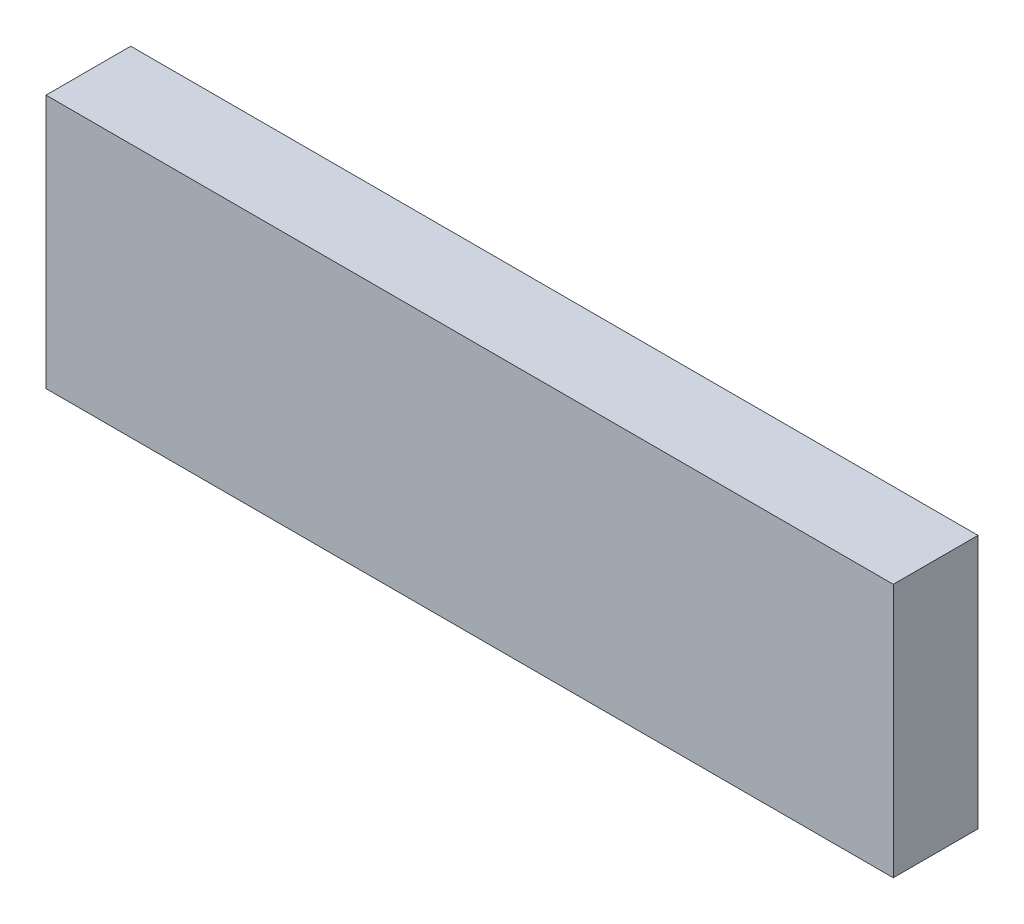
ISO-10303-21;
HEADER;
FILE_DESCRIPTION(('STEP AP214'),'2;1');
FILE_NAME('part.step','',(''),(''),'','','');
FILE_SCHEMA(('AUTOMOTIVE_DESIGN { 1 0 10303 214 1 1 1 1 }'));
ENDSEC;
DATA;
#1=APPLICATION_CONTEXT('core data for automotive mechanical design processes');
#2=APPLICATION_PROTOCOL_DEFINITION('international standard','automotive_design',2000,#1);
#3=PRODUCT_CONTEXT('',#1,'mechanical');
#4=PRODUCT('Part','Part','',(#3));
#5=PRODUCT_RELATED_PRODUCT_CATEGORY('part','',(#4));
#6=PRODUCT_DEFINITION_FORMATION('','',#4);
#7=PRODUCT_DEFINITION_CONTEXT('part definition',#1,'design');
#8=PRODUCT_DEFINITION('design','',#6,#7);
#9=PRODUCT_DEFINITION_SHAPE('','',#8);
#10=(LENGTH_UNIT() NAMED_UNIT(*) SI_UNIT(.MILLI.,.METRE.));
#11=(NAMED_UNIT(*) PLANE_ANGLE_UNIT() SI_UNIT($,.RADIAN.));
#12=(NAMED_UNIT(*) SI_UNIT($,.STERADIAN.) SOLID_ANGLE_UNIT());
#13=UNCERTAINTY_MEASURE_WITH_UNIT(LENGTH_MEASURE(1.E-05),#10,'distance_accuracy_value','');
#14=(GEOMETRIC_REPRESENTATION_CONTEXT(3) GLOBAL_UNCERTAINTY_ASSIGNED_CONTEXT((#13)) GLOBAL_UNIT_ASSIGNED_CONTEXT((#10,
#11,#12)) REPRESENTATION_CONTEXT('',''));
#15=CARTESIAN_POINT('',(0.,0.,0.));
#16=DIRECTION('',(0.,0.,1.));
#17=DIRECTION('',(1.,0.,0.));
#18=AXIS2_PLACEMENT_3D('',#15,#16,#17);
#19=CARTESIAN_POINT('',(-88.3485610984815,42.5439817471528,10.));
#20=DIRECTION('',(1.,0.,0.));
#21=DIRECTION('',(0.,0.,-1.));
#22=AXIS2_PLACEMENT_3D('',#19,#20,#21);
#23=PLANE('',#22);
#24=DIRECTION('',(0.,-1.,0.));
#25=VECTOR('',#24,1.);
#26=CARTESIAN_POINT('',(-88.3485610984815,42.5439817471528,0.));
#27=LINE('',#26,#25);
#28=CARTESIAN_POINT('',(-88.3485610984815,42.5439817471528,0.));
#29=VERTEX_POINT('',#28);
#30=CARTESIAN_POINT('',(-88.3485610984815,12.5439817471528,0.));
#31=VERTEX_POINT('',#30);
#32=EDGE_CURVE('E95',#29,#31,#27,.T.);
#33=ORIENTED_EDGE('',*,*,#32,.T.);
#34=DIRECTION('',(0.,0.,-1.));
#35=VECTOR('',#34,1.);
#36=CARTESIAN_POINT('',(-88.3485610984815,12.5439817471528,10.));
#37=LINE('',#36,#35);
#38=CARTESIAN_POINT('',(-88.3485610984815,12.5439817471528,10.));
#39=VERTEX_POINT('',#38);
#40=EDGE_CURVE('E11',#39,#31,#37,.T.);
#41=ORIENTED_EDGE('',*,*,#40,.F.);
#42=DIRECTION('',(0.,-1.,0.));
#43=VECTOR('',#42,1.);
#44=CARTESIAN_POINT('',(-88.3485610984815,42.5439817471528,10.));
#45=LINE('',#44,#43);
#46=CARTESIAN_POINT('',(-88.3485610984815,42.5439817471528,10.));
#47=VERTEX_POINT('',#46);
#48=EDGE_CURVE('E83',#47,#39,#45,.T.);
#49=ORIENTED_EDGE('',*,*,#48,.F.);
#50=DIRECTION('',(0.,0.,-1.));
#51=VECTOR('',#50,1.);
#52=CARTESIAN_POINT('',(-88.3485610984815,42.5439817471528,10.));
#53=LINE('',#52,#51);
#54=EDGE_CURVE('E91',#47,#29,#53,.T.);
#55=ORIENTED_EDGE('',*,*,#54,.T.);
#56=EDGE_LOOP('',(#33,#41,#49,#55));
#57=FACE_BOUND('',#56,.T.);
#58=ADVANCED_FACE('F32',(#57),#23,.F.);
#59=CARTESIAN_POINT('',(-88.3485610984815,12.5439817471528,10.));
#60=DIRECTION('',(0.,1.,0.));
#61=DIRECTION('',(0.,0.,1.));
#62=AXIS2_PLACEMENT_3D('',#59,#60,#61);
#63=PLANE('',#62);
#64=DIRECTION('',(1.,0.,0.));
#65=VECTOR('',#64,1.);
#66=CARTESIAN_POINT('',(-88.3485610984815,12.5439817471528,0.));
#67=LINE('',#66,#65);
#68=CARTESIAN_POINT('',(11.6514389015185,12.5439817471528,0.));
#69=VERTEX_POINT('',#68);
#70=EDGE_CURVE('E87',#31,#69,#67,.T.);
#71=ORIENTED_EDGE('',*,*,#70,.T.);
#72=DIRECTION('',(0.,0.,-1.));
#73=VECTOR('',#72,1.);
#74=CARTESIAN_POINT('',(11.6514389015185,12.5439817471528,10.));
#75=LINE('',#74,#73);
#76=CARTESIAN_POINT('',(11.6514389015185,12.5439817471528,10.));
#77=VERTEX_POINT('',#76);
#78=EDGE_CURVE('E40',#77,#69,#75,.T.);
#79=ORIENTED_EDGE('',*,*,#78,.F.);
#80=DIRECTION('',(1.,0.,0.));
#81=VECTOR('',#80,1.);
#82=CARTESIAN_POINT('',(-88.3485610984815,12.5439817471528,10.));
#83=LINE('',#82,#81);
#84=EDGE_CURVE('E78',#39,#77,#83,.T.);
#85=ORIENTED_EDGE('',*,*,#84,.F.);
#86=ORIENTED_EDGE('',*,*,#40,.T.);
#87=EDGE_LOOP('',(#71,#79,#85,#86));
#88=FACE_BOUND('',#87,.T.);
#89=ADVANCED_FACE('F86',(#88),#63,.F.);
#90=CARTESIAN_POINT('',(11.6514389015185,42.5439817471528,10.));
#91=DIRECTION('',(-1.,0.,0.));
#92=DIRECTION('',(0.,0.,1.));
#93=AXIS2_PLACEMENT_3D('',#90,#91,#92);
#94=PLANE('',#93);
#95=DIRECTION('',(0.,1.,0.));
#96=VECTOR('',#95,1.);
#97=CARTESIAN_POINT('',(11.6514389015185,42.5439817471528,0.));
#98=LINE('',#97,#96);
#99=CARTESIAN_POINT('',(11.6514389015185,42.5439817471528,0.));
#100=VERTEX_POINT('',#99);
#101=EDGE_CURVE('E65',#69,#100,#98,.T.);
#102=ORIENTED_EDGE('',*,*,#101,.T.);
#103=DIRECTION('',(0.,0.,-1.));
#104=VECTOR('',#103,1.);
#105=CARTESIAN_POINT('',(11.6514389015185,42.5439817471528,10.));
#106=LINE('',#105,#104);
#107=CARTESIAN_POINT('',(11.6514389015185,42.5439817471528,10.));
#108=VERTEX_POINT('',#107);
#109=EDGE_CURVE('E88',#108,#100,#106,.T.);
#110=ORIENTED_EDGE('',*,*,#109,.F.);
#111=DIRECTION('',(0.,1.,0.));
#112=VECTOR('',#111,1.);
#113=CARTESIAN_POINT('',(11.6514389015185,42.5439817471528,10.));
#114=LINE('',#113,#112);
#115=EDGE_CURVE('E81',#77,#108,#114,.T.);
#116=ORIENTED_EDGE('',*,*,#115,.F.);
#117=ORIENTED_EDGE('',*,*,#78,.T.);
#118=EDGE_LOOP('',(#102,#110,#116,#117));
#119=FACE_BOUND('',#118,.T.);
#120=ADVANCED_FACE('F89',(#119),#94,.F.);
#121=CARTESIAN_POINT('',(-88.3485610984815,42.5439817471528,10.));
#122=DIRECTION('',(0.,-1.,0.));
#123=DIRECTION('',(0.,0.,-1.));
#124=AXIS2_PLACEMENT_3D('',#121,#122,#123);
#125=PLANE('',#124);
#126=DIRECTION('',(-1.,0.,0.));
#127=VECTOR('',#126,1.);
#128=CARTESIAN_POINT('',(-88.3485610984815,42.5439817471528,0.));
#129=LINE('',#128,#127);
#130=EDGE_CURVE('E71',#100,#29,#129,.T.);
#131=ORIENTED_EDGE('',*,*,#130,.T.);
#132=ORIENTED_EDGE('',*,*,#54,.F.);
#133=DIRECTION('',(-1.,0.,0.));
#134=VECTOR('',#133,1.);
#135=CARTESIAN_POINT('',(-88.3485610984815,42.5439817471528,10.));
#136=LINE('',#135,#134);
#137=EDGE_CURVE('E48',#108,#47,#136,.T.);
#138=ORIENTED_EDGE('',*,*,#137,.F.);
#139=ORIENTED_EDGE('',*,*,#109,.T.);
#140=EDGE_LOOP('',(#131,#132,#138,#139));
#141=FACE_BOUND('',#140,.T.);
#142=ADVANCED_FACE('F102',(#141),#125,.F.);
#143=CARTESIAN_POINT('',(0.,0.,10.));
#144=DIRECTION('',(0.,0.,1.));
#145=DIRECTION('',(1.,0.,0.));
#146=AXIS2_PLACEMENT_3D('',#143,#144,#145);
#147=PLANE('',#146);
#148=ORIENTED_EDGE('',*,*,#48,.T.);
#149=ORIENTED_EDGE('',*,*,#84,.T.);
#150=ORIENTED_EDGE('',*,*,#115,.T.);
#151=ORIENTED_EDGE('',*,*,#137,.T.);
#152=EDGE_LOOP('',(#148,#149,#150,#151));
#153=FACE_BOUND('',#152,.T.);
#154=ADVANCED_FACE('F79',(#153),#147,.T.);
#155=CARTESIAN_POINT('',(0.,0.,0.));
#156=DIRECTION('',(0.,0.,1.));
#157=DIRECTION('',(1.,0.,0.));
#158=AXIS2_PLACEMENT_3D('',#155,#156,#157);
#159=PLANE('',#158);
#160=ORIENTED_EDGE('',*,*,#32,.F.);
#161=ORIENTED_EDGE('',*,*,#130,.F.);
#162=ORIENTED_EDGE('',*,*,#101,.F.);
#163=ORIENTED_EDGE('',*,*,#70,.F.);
#164=EDGE_LOOP('',(#160,#161,#162,#163));
#165=FACE_BOUND('',#164,.T.);
#166=ADVANCED_FACE('F105',(#165),#159,.F.);
#167=CLOSED_SHELL('',(#58,#89,#120,#142,#154,#166));
#168=MANIFOLD_SOLID_BREP('B2',#167);
#169=ADVANCED_BREP_SHAPE_REPRESENTATION('',(#18,#168),#14);
#170=SHAPE_DEFINITION_REPRESENTATION(#9,#169);
ENDSEC;
END-ISO-10303-21;
